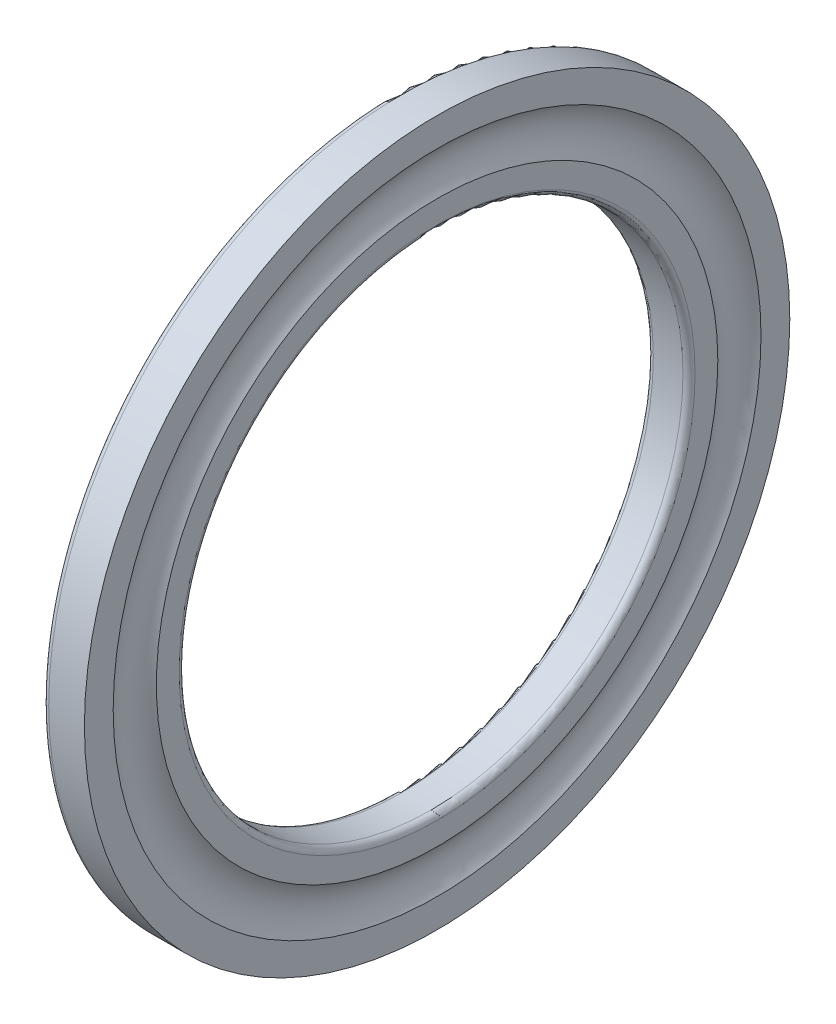
ISO-10303-21;
HEADER;
FILE_DESCRIPTION(('STEP AP214'),'2;1');
FILE_NAME('part.step','',(''),(''),'','','');
FILE_SCHEMA(('AUTOMOTIVE_DESIGN { 1 0 10303 214 1 1 1 1 }'));
ENDSEC;
DATA;
#1=APPLICATION_CONTEXT('core data for automotive mechanical design processes');
#2=APPLICATION_PROTOCOL_DEFINITION('international standard','automotive_design',2000,#1);
#3=PRODUCT_CONTEXT('',#1,'mechanical');
#4=PRODUCT('Part','Part','',(#3));
#5=PRODUCT_RELATED_PRODUCT_CATEGORY('part','',(#4));
#6=PRODUCT_DEFINITION_FORMATION('','',#4);
#7=PRODUCT_DEFINITION_CONTEXT('part definition',#1,'design');
#8=PRODUCT_DEFINITION('design','',#6,#7);
#9=PRODUCT_DEFINITION_SHAPE('','',#8);
#10=(LENGTH_UNIT() NAMED_UNIT(*) SI_UNIT(.MILLI.,.METRE.));
#11=(NAMED_UNIT(*) PLANE_ANGLE_UNIT() SI_UNIT($,.RADIAN.));
#12=(NAMED_UNIT(*) SI_UNIT($,.STERADIAN.) SOLID_ANGLE_UNIT());
#13=UNCERTAINTY_MEASURE_WITH_UNIT(LENGTH_MEASURE(1.E-05),#10,'distance_accuracy_value','');
#14=(GEOMETRIC_REPRESENTATION_CONTEXT(3) GLOBAL_UNCERTAINTY_ASSIGNED_CONTEXT((#13)) GLOBAL_UNIT_ASSIGNED_CONTEXT((#10,
#11,#12)) REPRESENTATION_CONTEXT('',''));
#15=CARTESIAN_POINT('',(0.,0.,0.));
#16=DIRECTION('',(0.,0.,1.));
#17=DIRECTION('',(1.,0.,0.));
#18=AXIS2_PLACEMENT_3D('',#15,#16,#17);
#19=CARTESIAN_POINT('',(0.59999999999987,0.,0.));
#20=DIRECTION('',(1.,0.,0.));
#21=DIRECTION('',(0.,0.,-1.));
#22=AXIS2_PLACEMENT_3D('',#19,#20,#21);
#23=TOROIDAL_SURFACE('',#22,25.5999999999999,0.599999999999871);
#24=CARTESIAN_POINT('',(0.6,0.,0.));
#25=DIRECTION('',(1.,0.,0.));
#26=DIRECTION('',(0.,0.,-1.));
#27=AXIS2_PLACEMENT_3D('',#24,#25,#26);
#28=CIRCLE('',#27,25.);
#29=CARTESIAN_POINT('',(0.6,0.,-25.));
#30=VERTEX_POINT('',#29);
#31=EDGE_CURVE('E10',#30,#30,#28,.T.);
#32=ORIENTED_EDGE('',*,*,#31,.T.);
#33=EDGE_LOOP('',(#32));
#34=FACE_BOUND('',#33,.T.);
#35=CARTESIAN_POINT('',(0.,0.,0.));
#36=DIRECTION('',(1.,0.,0.));
#37=DIRECTION('',(0.,0.,-1.));
#38=AXIS2_PLACEMENT_3D('',#35,#36,#37);
#39=CIRCLE('',#38,25.6);
#40=CARTESIAN_POINT('',(0.,0.,-25.6));
#41=VERTEX_POINT('',#40);
#42=EDGE_CURVE('E60',#41,#41,#39,.T.);
#43=ORIENTED_EDGE('',*,*,#42,.F.);
#44=EDGE_LOOP('',(#43));
#45=FACE_BOUND('',#44,.T.);
#46=ADVANCED_FACE('F29',(#34,#45),#23,.T.);
#47=CARTESIAN_POINT('',(3.542,0.,0.));
#48=DIRECTION('',(1.,0.,0.));
#49=DIRECTION('',(0.,0.,-1.));
#50=AXIS2_PLACEMENT_3D('',#47,#48,#49);
#51=CYLINDRICAL_SURFACE('',#50,25.);
#52=CARTESIAN_POINT('',(3.542,0.,0.));
#53=DIRECTION('',(1.,0.,0.));
#54=DIRECTION('',(0.,0.,-1.));
#55=AXIS2_PLACEMENT_3D('',#52,#53,#54);
#56=CIRCLE('',#55,25.);
#57=CARTESIAN_POINT('',(3.542,0.,-25.));
#58=VERTEX_POINT('',#57);
#59=EDGE_CURVE('E35',#58,#58,#56,.T.);
#60=ORIENTED_EDGE('',*,*,#59,.T.);
#61=EDGE_LOOP('',(#60));
#62=FACE_BOUND('',#61,.T.);
#63=ORIENTED_EDGE('',*,*,#31,.F.);
#64=EDGE_LOOP('',(#63));
#65=FACE_BOUND('',#64,.T.);
#66=ADVANCED_FACE('F68',(#62,#65),#51,.F.);
#67=CARTESIAN_POINT('',(3.54200000000008,0.,0.));
#68=DIRECTION('',(1.,0.,0.));
#69=DIRECTION('',(0.,0.,-1.));
#70=AXIS2_PLACEMENT_3D('',#67,#68,#69);
#71=TOROIDAL_SURFACE('',#70,25.5999999999999,0.599999999999925);
#72=CARTESIAN_POINT('',(4.142,0.,0.));
#73=DIRECTION('',(1.,0.,0.));
#74=DIRECTION('',(0.,0.,-1.));
#75=AXIS2_PLACEMENT_3D('',#72,#73,#74);
#76=CIRCLE('',#75,25.6);
#77=CARTESIAN_POINT('',(4.142,0.,-25.6));
#78=VERTEX_POINT('',#77);
#79=EDGE_CURVE('E39',#78,#78,#76,.T.);
#80=ORIENTED_EDGE('',*,*,#79,.T.);
#81=EDGE_LOOP('',(#80));
#82=FACE_BOUND('',#81,.T.);
#83=ORIENTED_EDGE('',*,*,#59,.F.);
#84=EDGE_LOOP('',(#83));
#85=FACE_BOUND('',#84,.T.);
#86=ADVANCED_FACE('F72',(#82,#85),#71,.T.);
#87=CARTESIAN_POINT('',(4.142,25.6,0.));
#88=DIRECTION('',(1.,0.,0.));
#89=DIRECTION('',(0.,0.,-1.));
#90=AXIS2_PLACEMENT_3D('',#87,#88,#89);
#91=PLANE('',#90);
#92=CARTESIAN_POINT('',(4.142,0.,0.));
#93=DIRECTION('',(1.,0.,0.));
#94=DIRECTION('',(0.,0.,-1.));
#95=AXIS2_PLACEMENT_3D('',#92,#93,#94);
#96=CIRCLE('',#95,27.857333437046);
#97=CARTESIAN_POINT('',(4.142,0.,-27.857333437046));
#98=VERTEX_POINT('',#97);
#99=EDGE_CURVE('E43',#98,#98,#96,.T.);
#100=ORIENTED_EDGE('',*,*,#99,.T.);
#101=EDGE_LOOP('',(#100));
#102=FACE_BOUND('',#101,.T.);
#103=ORIENTED_EDGE('',*,*,#79,.F.);
#104=EDGE_LOOP('',(#103));
#105=FACE_BOUND('',#104,.T.);
#106=ADVANCED_FACE('F76',(#102,#105),#91,.T.);
#107=CARTESIAN_POINT('',(7.00000000000079,0.,0.));
#108=DIRECTION('',(1.,0.,0.));
#109=DIRECTION('',(0.,0.,-1.));
#110=AXIS2_PLACEMENT_3D('',#107,#108,#109);
#111=TOROIDAL_SURFACE('',#110,30.,3.57200000000079);
#112=CARTESIAN_POINT('',(4.142,0.,0.));
#113=DIRECTION('',(1.,0.,0.));
#114=DIRECTION('',(0.,0.,-1.));
#115=AXIS2_PLACEMENT_3D('',#112,#113,#114);
#116=CIRCLE('',#115,32.142666562954);
#117=CARTESIAN_POINT('',(4.142,0.,-32.142666562954));
#118=VERTEX_POINT('',#117);
#119=EDGE_CURVE('E48',#118,#118,#116,.T.);
#120=ORIENTED_EDGE('',*,*,#119,.T.);
#121=EDGE_LOOP('',(#120));
#122=FACE_BOUND('',#121,.T.);
#123=ORIENTED_EDGE('',*,*,#99,.F.);
#124=EDGE_LOOP('',(#123));
#125=FACE_BOUND('',#124,.T.);
#126=ADVANCED_FACE('F83',(#122,#125),#111,.F.);
#127=CARTESIAN_POINT('',(4.142,32.142666562954,0.));
#128=DIRECTION('',(1.,0.,0.));
#129=DIRECTION('',(0.,0.,-1.));
#130=AXIS2_PLACEMENT_3D('',#127,#128,#129);
#131=PLANE('',#130);
#132=CARTESIAN_POINT('',(4.142,0.,0.));
#133=DIRECTION('',(1.,0.,0.));
#134=DIRECTION('',(0.,0.,-1.));
#135=AXIS2_PLACEMENT_3D('',#132,#133,#134);
#136=CIRCLE('',#135,35.);
#137=CARTESIAN_POINT('',(4.142,0.,-35.));
#138=VERTEX_POINT('',#137);
#139=EDGE_CURVE('E51',#138,#138,#136,.T.);
#140=ORIENTED_EDGE('',*,*,#139,.T.);
#141=EDGE_LOOP('',(#140));
#142=FACE_BOUND('',#141,.T.);
#143=ORIENTED_EDGE('',*,*,#119,.F.);
#144=EDGE_LOOP('',(#143));
#145=FACE_BOUND('',#144,.T.);
#146=ADVANCED_FACE('F87',(#142,#145),#131,.T.);
#147=CARTESIAN_POINT('',(3.542,0.,0.));
#148=DIRECTION('',(1.,0.,0.));
#149=DIRECTION('',(0.,0.,-1.));
#150=AXIS2_PLACEMENT_3D('',#147,#148,#149);
#151=CYLINDRICAL_SURFACE('',#150,35.);
#152=CARTESIAN_POINT('',(0.6,0.,0.));
#153=DIRECTION('',(1.,0.,0.));
#154=DIRECTION('',(0.,0.,-1.));
#155=AXIS2_PLACEMENT_3D('',#152,#153,#154);
#156=CIRCLE('',#155,35.);
#157=CARTESIAN_POINT('',(0.6,0.,-35.));
#158=VERTEX_POINT('',#157);
#159=EDGE_CURVE('E54',#158,#158,#156,.T.);
#160=ORIENTED_EDGE('',*,*,#159,.T.);
#161=EDGE_LOOP('',(#160));
#162=FACE_BOUND('',#161,.T.);
#163=ORIENTED_EDGE('',*,*,#139,.F.);
#164=EDGE_LOOP('',(#163));
#165=FACE_BOUND('',#164,.T.);
#166=ADVANCED_FACE('F91',(#162,#165),#151,.T.);
#167=CARTESIAN_POINT('',(0.599999999999878,0.,0.));
#168=DIRECTION('',(1.,0.,0.));
#169=DIRECTION('',(0.,0.,-1.));
#170=AXIS2_PLACEMENT_3D('',#167,#168,#169);
#171=TOROIDAL_SURFACE('',#170,34.4000000000001,0.599999999999878);
#172=CARTESIAN_POINT('',(0.,0.,0.));
#173=DIRECTION('',(1.,0.,0.));
#174=DIRECTION('',(0.,0.,-1.));
#175=AXIS2_PLACEMENT_3D('',#172,#173,#174);
#176=CIRCLE('',#175,34.4);
#177=CARTESIAN_POINT('',(0.,0.,-34.4));
#178=VERTEX_POINT('',#177);
#179=EDGE_CURVE('E57',#178,#178,#176,.T.);
#180=ORIENTED_EDGE('',*,*,#179,.T.);
#181=EDGE_LOOP('',(#180));
#182=FACE_BOUND('',#181,.T.);
#183=ORIENTED_EDGE('',*,*,#159,.F.);
#184=EDGE_LOOP('',(#183));
#185=FACE_BOUND('',#184,.T.);
#186=ADVANCED_FACE('F95',(#182,#185),#171,.T.);
#187=CARTESIAN_POINT('',(0.,34.4,0.));
#188=DIRECTION('',(-1.,0.,0.));
#189=DIRECTION('',(0.,0.,1.));
#190=AXIS2_PLACEMENT_3D('',#187,#188,#189);
#191=PLANE('',#190);
#192=ORIENTED_EDGE('',*,*,#42,.T.);
#193=EDGE_LOOP('',(#192));
#194=FACE_BOUND('',#193,.T.);
#195=ORIENTED_EDGE('',*,*,#179,.F.);
#196=EDGE_LOOP('',(#195));
#197=FACE_BOUND('',#196,.T.);
#198=ADVANCED_FACE('F64',(#194,#197),#191,.T.);
#199=CLOSED_SHELL('',(#46,#66,#86,#106,#126,#146,#166,#186,#198));
#200=MANIFOLD_SOLID_BREP('B2',#199);
#201=ADVANCED_BREP_SHAPE_REPRESENTATION('',(#18,#200),#14);
#202=SHAPE_DEFINITION_REPRESENTATION(#9,#201);
ENDSEC;
END-ISO-10303-21;
